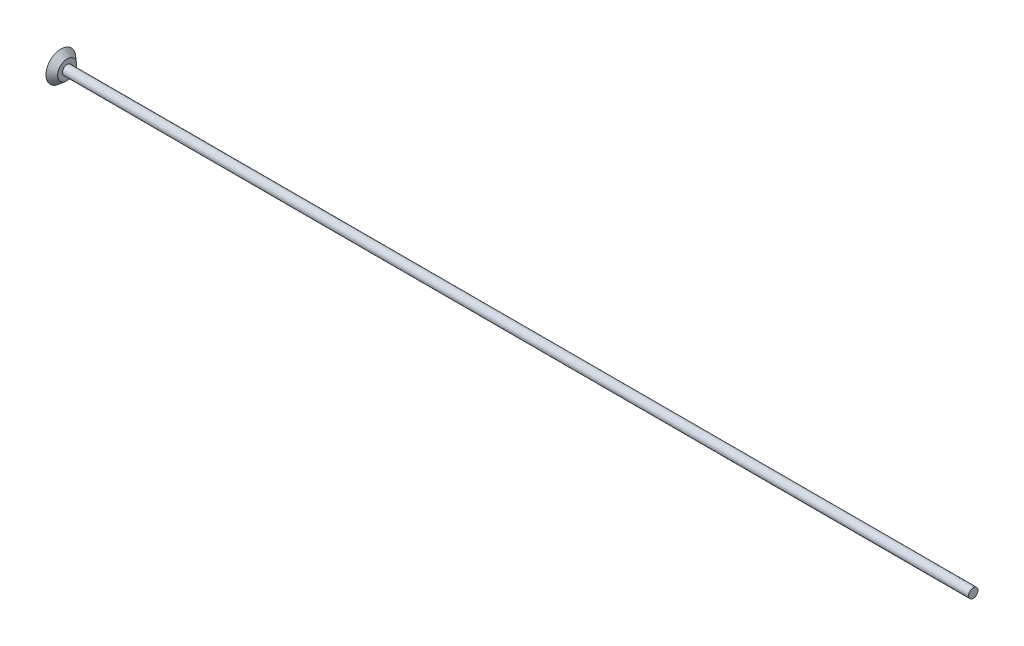
ISO-10303-21;
HEADER;
FILE_DESCRIPTION(('STEP AP214'),'2;1');
FILE_NAME('part.step','',(''),(''),'','','');
FILE_SCHEMA(('AUTOMOTIVE_DESIGN { 1 0 10303 214 1 1 1 1 }'));
ENDSEC;
DATA;
#1=APPLICATION_CONTEXT('core data for automotive mechanical design processes');
#2=APPLICATION_PROTOCOL_DEFINITION('international standard','automotive_design',2000,#1);
#3=PRODUCT_CONTEXT('',#1,'mechanical');
#4=PRODUCT('Part','Part','',(#3));
#5=PRODUCT_RELATED_PRODUCT_CATEGORY('part','',(#4));
#6=PRODUCT_DEFINITION_FORMATION('','',#4);
#7=PRODUCT_DEFINITION_CONTEXT('part definition',#1,'design');
#8=PRODUCT_DEFINITION('design','',#6,#7);
#9=PRODUCT_DEFINITION_SHAPE('','',#8);
#10=(LENGTH_UNIT() NAMED_UNIT(*) SI_UNIT(.MILLI.,.METRE.));
#11=(NAMED_UNIT(*) PLANE_ANGLE_UNIT() SI_UNIT($,.RADIAN.));
#12=(NAMED_UNIT(*) SI_UNIT($,.STERADIAN.) SOLID_ANGLE_UNIT());
#13=UNCERTAINTY_MEASURE_WITH_UNIT(LENGTH_MEASURE(1.E-05),#10,'distance_accuracy_value','');
#14=(GEOMETRIC_REPRESENTATION_CONTEXT(3) GLOBAL_UNCERTAINTY_ASSIGNED_CONTEXT((#13)) GLOBAL_UNIT_ASSIGNED_CONTEXT((#10,
#11,#12)) REPRESENTATION_CONTEXT('',''));
#15=CARTESIAN_POINT('',(0.,0.,0.));
#16=DIRECTION('',(0.,0.,1.));
#17=DIRECTION('',(1.,0.,0.));
#18=AXIS2_PLACEMENT_3D('',#15,#16,#17);
#19=CARTESIAN_POINT('',(0.,0.,0.));
#20=DIRECTION('',(-1.,0.,0.));
#21=DIRECTION('',(0.,0.,1.));
#22=AXIS2_PLACEMENT_3D('',#19,#20,#21);
#23=PLANE('',#22);
#24=CARTESIAN_POINT('',(0.,0.,0.));
#25=DIRECTION('',(1.,0.,0.));
#26=DIRECTION('',(0.,0.,-1.));
#27=AXIS2_PLACEMENT_3D('',#24,#25,#26);
#28=CIRCLE('',#27,4.7625);
#29=CARTESIAN_POINT('',(0.,0.,-4.7625));
#30=VERTEX_POINT('',#29);
#31=EDGE_CURVE('E10',#30,#30,#28,.T.);
#32=ORIENTED_EDGE('',*,*,#31,.F.);
#33=EDGE_LOOP('',(#32));
#34=FACE_BOUND('',#33,.T.);
#35=ADVANCED_FACE('F34',(#34),#23,.T.);
#36=CARTESIAN_POINT('',(2.,0.,0.));
#37=DIRECTION('',(-1.,0.,0.));
#38=DIRECTION('',(0.,0.,1.));
#39=AXIS2_PLACEMENT_3D('',#36,#37,#38);
#40=CONICAL_SURFACE('',#39,3.0136281467128,0.718510435125885);
#41=ORIENTED_EDGE('',*,*,#31,.T.);
#42=EDGE_LOOP('',(#41));
#43=FACE_BOUND('',#42,.T.);
#44=CARTESIAN_POINT('',(2.,0.,0.));
#45=DIRECTION('',(1.,0.,0.));
#46=DIRECTION('',(0.,0.,-1.));
#47=AXIS2_PLACEMENT_3D('',#44,#45,#46);
#48=CIRCLE('',#47,3.0136281467128);
#49=CARTESIAN_POINT('',(2.,0.,-3.0136281467128));
#50=VERTEX_POINT('',#49);
#51=EDGE_CURVE('E40',#50,#50,#48,.T.);
#52=ORIENTED_EDGE('',*,*,#51,.F.);
#53=EDGE_LOOP('',(#52));
#54=FACE_BOUND('',#53,.T.);
#55=ADVANCED_FACE('F66',(#43,#54),#40,.T.);
#56=CARTESIAN_POINT('',(2.,0.,-3.0136281467128));
#57=DIRECTION('',(1.,0.,0.));
#58=DIRECTION('',(0.,0.,-1.));
#59=AXIS2_PLACEMENT_3D('',#56,#57,#58);
#60=PLANE('',#59);
#61=ORIENTED_EDGE('',*,*,#51,.T.);
#62=EDGE_LOOP('',(#61));
#63=FACE_BOUND('',#62,.T.);
#64=CARTESIAN_POINT('',(2.,0.,0.));
#65=DIRECTION('',(1.,0.,0.));
#66=DIRECTION('',(0.,0.,-1.));
#67=AXIS2_PLACEMENT_3D('',#64,#65,#66);
#68=CIRCLE('',#67,1.49999999999999);
#69=CARTESIAN_POINT('',(2.,0.,-1.49999999999999));
#70=VERTEX_POINT('',#69);
#71=EDGE_CURVE('E44',#70,#70,#68,.T.);
#72=ORIENTED_EDGE('',*,*,#71,.F.);
#73=EDGE_LOOP('',(#72));
#74=FACE_BOUND('',#73,.T.);
#75=ADVANCED_FACE('F58',(#63,#74),#60,.T.);
#76=CARTESIAN_POINT('',(292.03068622274,0.,0.));
#77=DIRECTION('',(1.,0.,0.));
#78=DIRECTION('',(0.,0.,-1.));
#79=AXIS2_PLACEMENT_3D('',#76,#77,#78);
#80=CYLINDRICAL_SURFACE('',#79,1.49999999999999);
#81=ORIENTED_EDGE('',*,*,#71,.T.);
#82=EDGE_LOOP('',(#81));
#83=FACE_BOUND('',#82,.T.);
#84=CARTESIAN_POINT('',(292.03068622274,0.,0.));
#85=DIRECTION('',(1.,0.,0.));
#86=DIRECTION('',(0.,0.,-1.));
#87=AXIS2_PLACEMENT_3D('',#84,#85,#86);
#88=CIRCLE('',#87,1.49999999999999);
#89=CARTESIAN_POINT('',(292.03068622274,0.,-1.49999999999999));
#90=VERTEX_POINT('',#89);
#91=EDGE_CURVE('E48',#90,#90,#88,.T.);
#92=ORIENTED_EDGE('',*,*,#91,.F.);
#93=EDGE_LOOP('',(#92));
#94=FACE_BOUND('',#93,.T.);
#95=ADVANCED_FACE('F56',(#83,#94),#80,.T.);
#96=CARTESIAN_POINT('',(292.03068622274,0.,-1.49999999999999));
#97=DIRECTION('',(1.,0.,0.));
#98=DIRECTION('',(0.,0.,-1.));
#99=AXIS2_PLACEMENT_3D('',#96,#97,#98);
#100=PLANE('',#99);
#101=ORIENTED_EDGE('',*,*,#91,.T.);
#102=EDGE_LOOP('',(#101));
#103=FACE_BOUND('',#102,.T.);
#104=ADVANCED_FACE('F54',(#103),#100,.T.);
#105=CLOSED_SHELL('',(#35,#55,#75,#95,#104));
#106=MANIFOLD_SOLID_BREP('B2',#105);
#107=ADVANCED_BREP_SHAPE_REPRESENTATION('',(#18,#106),#14);
#108=SHAPE_DEFINITION_REPRESENTATION(#9,#107);
ENDSEC;
END-ISO-10303-21;
